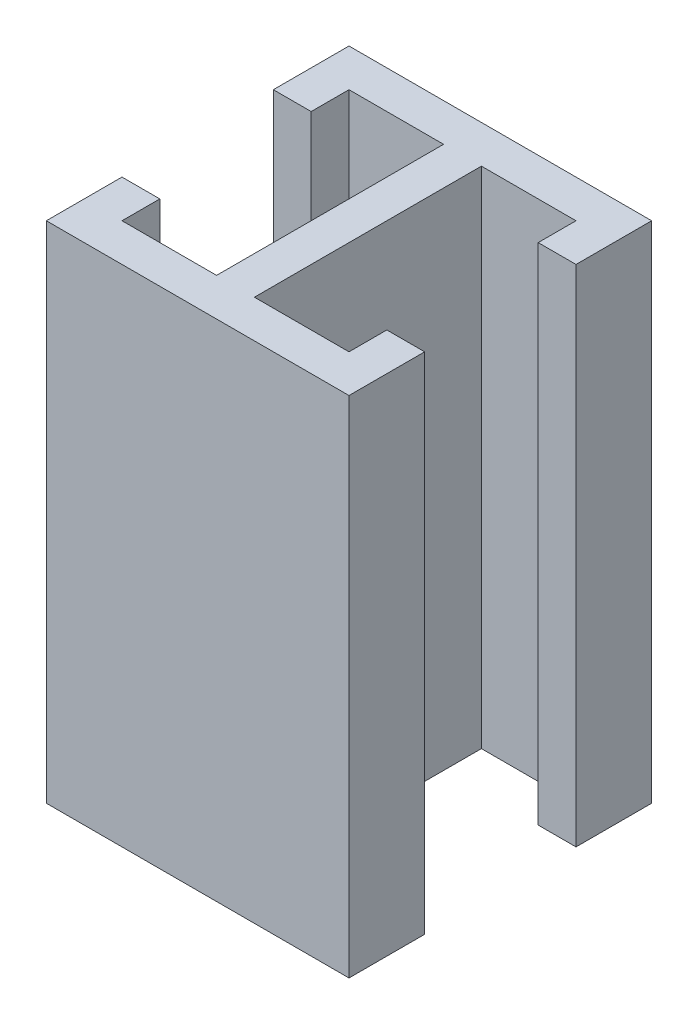
ISO-10303-21;
HEADER;
FILE_DESCRIPTION(('STEP AP214'),'2;1');
FILE_NAME('part.step','',(''),(''),'','','');
FILE_SCHEMA(('AUTOMOTIVE_DESIGN { 1 0 10303 214 1 1 1 1 }'));
ENDSEC;
DATA;
#1=APPLICATION_CONTEXT('core data for automotive mechanical design processes');
#2=APPLICATION_PROTOCOL_DEFINITION('international standard','automotive_design',2000,#1);
#3=PRODUCT_CONTEXT('',#1,'mechanical');
#4=PRODUCT('Part','Part','',(#3));
#5=PRODUCT_RELATED_PRODUCT_CATEGORY('part','',(#4));
#6=PRODUCT_DEFINITION_FORMATION('','',#4);
#7=PRODUCT_DEFINITION_CONTEXT('part definition',#1,'design');
#8=PRODUCT_DEFINITION('design','',#6,#7);
#9=PRODUCT_DEFINITION_SHAPE('','',#8);
#10=(LENGTH_UNIT() NAMED_UNIT(*) SI_UNIT(.MILLI.,.METRE.));
#11=(NAMED_UNIT(*) PLANE_ANGLE_UNIT() SI_UNIT($,.RADIAN.));
#12=(NAMED_UNIT(*) SI_UNIT($,.STERADIAN.) SOLID_ANGLE_UNIT());
#13=UNCERTAINTY_MEASURE_WITH_UNIT(LENGTH_MEASURE(1.E-05),#10,'distance_accuracy_value','');
#14=(GEOMETRIC_REPRESENTATION_CONTEXT(3) GLOBAL_UNCERTAINTY_ASSIGNED_CONTEXT((#13)) GLOBAL_UNIT_ASSIGNED_CONTEXT((#10,
#11,#12)) REPRESENTATION_CONTEXT('',''));
#15=CARTESIAN_POINT('',(0.,0.,0.));
#16=DIRECTION('',(0.,0.,1.));
#17=DIRECTION('',(1.,0.,0.));
#18=AXIS2_PLACEMENT_3D('',#15,#16,#17);
#19=CARTESIAN_POINT('',(0.,200.,0.));
#20=DIRECTION('',(1.,0.,0.));
#21=DIRECTION('',(0.,0.,-1.));
#22=AXIS2_PLACEMENT_3D('',#19,#20,#21);
#23=PLANE('',#22);
#24=DIRECTION('',(0.,0.,1.));
#25=VECTOR('',#24,1.);
#26=CARTESIAN_POINT('',(0.,0.,0.));
#27=LINE('',#26,#25);
#28=CARTESIAN_POINT('',(0.,0.,-30.));
#29=VERTEX_POINT('',#28);
#30=CARTESIAN_POINT('',(0.,0.,0.));
#31=VERTEX_POINT('',#30);
#32=EDGE_CURVE('E216',#29,#31,#27,.T.);
#33=ORIENTED_EDGE('',*,*,#32,.T.);
#34=DIRECTION('',(0.,-1.,0.));
#35=VECTOR('',#34,1.);
#36=CARTESIAN_POINT('',(0.,200.,0.));
#37=LINE('',#36,#35);
#38=CARTESIAN_POINT('',(0.,200.,0.));
#39=VERTEX_POINT('',#38);
#40=EDGE_CURVE('E11',#39,#31,#37,.T.);
#41=ORIENTED_EDGE('',*,*,#40,.F.);
#42=DIRECTION('',(0.,0.,1.));
#43=VECTOR('',#42,1.);
#44=CARTESIAN_POINT('',(0.,200.,0.));
#45=LINE('',#44,#43);
#46=CARTESIAN_POINT('',(0.,200.,-30.));
#47=VERTEX_POINT('',#46);
#48=EDGE_CURVE('E274',#47,#39,#45,.T.);
#49=ORIENTED_EDGE('',*,*,#48,.F.);
#50=DIRECTION('',(0.,-1.,0.));
#51=VECTOR('',#50,1.);
#52=CARTESIAN_POINT('',(0.,200.,-30.));
#53=LINE('',#52,#51);
#54=EDGE_CURVE('E212',#47,#29,#53,.T.);
#55=ORIENTED_EDGE('',*,*,#54,.T.);
#56=EDGE_LOOP('',(#33,#41,#49,#55));
#57=FACE_BOUND('',#56,.T.);
#58=ADVANCED_FACE('F43',(#57),#23,.F.);
#59=CARTESIAN_POINT('',(0.,200.,0.));
#60=DIRECTION('',(0.,0.,-1.));
#61=DIRECTION('',(-1.,0.,0.));
#62=AXIS2_PLACEMENT_3D('',#59,#60,#61);
#63=PLANE('',#62);
#64=DIRECTION('',(1.,0.,0.));
#65=VECTOR('',#64,1.);
#66=CARTESIAN_POINT('',(0.,0.,0.));
#67=LINE('',#66,#65);
#68=CARTESIAN_POINT('',(120.,0.,0.));
#69=VERTEX_POINT('',#68);
#70=EDGE_CURVE('E220',#31,#69,#67,.T.);
#71=ORIENTED_EDGE('',*,*,#70,.T.);
#72=DIRECTION('',(0.,-1.,0.));
#73=VECTOR('',#72,1.);
#74=CARTESIAN_POINT('',(120.,200.,0.));
#75=LINE('',#74,#73);
#76=CARTESIAN_POINT('',(120.,200.,0.));
#77=VERTEX_POINT('',#76);
#78=EDGE_CURVE('E52',#77,#69,#75,.T.);
#79=ORIENTED_EDGE('',*,*,#78,.F.);
#80=DIRECTION('',(1.,0.,0.));
#81=VECTOR('',#80,1.);
#82=CARTESIAN_POINT('',(0.,200.,0.));
#83=LINE('',#82,#81);
#84=EDGE_CURVE('E139',#39,#77,#83,.T.);
#85=ORIENTED_EDGE('',*,*,#84,.F.);
#86=ORIENTED_EDGE('',*,*,#40,.T.);
#87=EDGE_LOOP('',(#71,#79,#85,#86));
#88=FACE_BOUND('',#87,.T.);
#89=ADVANCED_FACE('F424',(#88),#63,.F.);
#90=CARTESIAN_POINT('',(120.,200.,0.));
#91=DIRECTION('',(-1.,0.,0.));
#92=DIRECTION('',(0.,0.,1.));
#93=AXIS2_PLACEMENT_3D('',#90,#91,#92);
#94=PLANE('',#93);
#95=DIRECTION('',(0.,0.,-1.));
#96=VECTOR('',#95,1.);
#97=CARTESIAN_POINT('',(120.,0.,0.));
#98=LINE('',#97,#96);
#99=CARTESIAN_POINT('',(120.,0.,-30.));
#100=VERTEX_POINT('',#99);
#101=EDGE_CURVE('E223',#69,#100,#98,.T.);
#102=ORIENTED_EDGE('',*,*,#101,.T.);
#103=DIRECTION('',(0.,-1.,0.));
#104=VECTOR('',#103,1.);
#105=CARTESIAN_POINT('',(120.,200.,-30.));
#106=LINE('',#105,#104);
#107=CARTESIAN_POINT('',(120.,200.,-30.));
#108=VERTEX_POINT('',#107);
#109=EDGE_CURVE('E333',#108,#100,#106,.T.);
#110=ORIENTED_EDGE('',*,*,#109,.F.);
#111=DIRECTION('',(0.,0.,-1.));
#112=VECTOR('',#111,1.);
#113=CARTESIAN_POINT('',(120.,200.,0.));
#114=LINE('',#113,#112);
#115=EDGE_CURVE('E343',#77,#108,#114,.T.);
#116=ORIENTED_EDGE('',*,*,#115,.F.);
#117=ORIENTED_EDGE('',*,*,#78,.T.);
#118=EDGE_LOOP('',(#102,#110,#116,#117));
#119=FACE_BOUND('',#118,.T.);
#120=ADVANCED_FACE('F341',(#119),#94,.F.);
#121=CARTESIAN_POINT('',(105.,200.,-30.));
#122=DIRECTION('',(0.,0.,1.));
#123=DIRECTION('',(1.,0.,0.));
#124=AXIS2_PLACEMENT_3D('',#121,#122,#123);
#125=PLANE('',#124);
#126=DIRECTION('',(-1.,0.,0.));
#127=VECTOR('',#126,1.);
#128=CARTESIAN_POINT('',(105.,0.,-30.));
#129=LINE('',#128,#127);
#130=CARTESIAN_POINT('',(105.,0.,-30.));
#131=VERTEX_POINT('',#130);
#132=EDGE_CURVE('E226',#100,#131,#129,.T.);
#133=ORIENTED_EDGE('',*,*,#132,.T.);
#134=DIRECTION('',(0.,-1.,0.));
#135=VECTOR('',#134,1.);
#136=CARTESIAN_POINT('',(105.,200.,-30.));
#137=LINE('',#136,#135);
#138=CARTESIAN_POINT('',(105.,200.,-30.));
#139=VERTEX_POINT('',#138);
#140=EDGE_CURVE('E329',#139,#131,#137,.T.);
#141=ORIENTED_EDGE('',*,*,#140,.F.);
#142=DIRECTION('',(-1.,0.,0.));
#143=VECTOR('',#142,1.);
#144=CARTESIAN_POINT('',(105.,200.,-30.));
#145=LINE('',#144,#143);
#146=EDGE_CURVE('E362',#108,#139,#145,.T.);
#147=ORIENTED_EDGE('',*,*,#146,.F.);
#148=ORIENTED_EDGE('',*,*,#109,.T.);
#149=EDGE_LOOP('',(#133,#141,#147,#148));
#150=FACE_BOUND('',#149,.T.);
#151=ADVANCED_FACE('F352',(#150),#125,.F.);
#152=CARTESIAN_POINT('',(105.,200.,-30.));
#153=DIRECTION('',(1.,0.,0.));
#154=DIRECTION('',(0.,0.,-1.));
#155=AXIS2_PLACEMENT_3D('',#152,#153,#154);
#156=PLANE('',#155);
#157=DIRECTION('',(0.,0.,1.));
#158=VECTOR('',#157,1.);
#159=CARTESIAN_POINT('',(105.,0.,-30.));
#160=LINE('',#159,#158);
#161=CARTESIAN_POINT('',(105.,0.,-15.));
#162=VERTEX_POINT('',#161);
#163=EDGE_CURVE('E229',#131,#162,#160,.T.);
#164=ORIENTED_EDGE('',*,*,#163,.T.);
#165=DIRECTION('',(0.,-1.,0.));
#166=VECTOR('',#165,1.);
#167=CARTESIAN_POINT('',(105.,200.,-15.));
#168=LINE('',#167,#166);
#169=CARTESIAN_POINT('',(105.,200.,-15.));
#170=VERTEX_POINT('',#169);
#171=EDGE_CURVE('E325',#170,#162,#168,.T.);
#172=ORIENTED_EDGE('',*,*,#171,.F.);
#173=DIRECTION('',(0.,0.,1.));
#174=VECTOR('',#173,1.);
#175=CARTESIAN_POINT('',(105.,200.,-30.));
#176=LINE('',#175,#174);
#177=EDGE_CURVE('E358',#139,#170,#176,.T.);
#178=ORIENTED_EDGE('',*,*,#177,.F.);
#179=ORIENTED_EDGE('',*,*,#140,.T.);
#180=EDGE_LOOP('',(#164,#172,#178,#179));
#181=FACE_BOUND('',#180,.T.);
#182=ADVANCED_FACE('F356',(#181),#156,.F.);
#183=CARTESIAN_POINT('',(67.5,200.,-15.));
#184=DIRECTION('',(0.,0.,1.));
#185=DIRECTION('',(1.,0.,0.));
#186=AXIS2_PLACEMENT_3D('',#183,#184,#185);
#187=PLANE('',#186);
#188=DIRECTION('',(-1.,0.,0.));
#189=VECTOR('',#188,1.);
#190=CARTESIAN_POINT('',(67.5,0.,-15.));
#191=LINE('',#190,#189);
#192=CARTESIAN_POINT('',(67.5,0.,-15.));
#193=VERTEX_POINT('',#192);
#194=EDGE_CURVE('E232',#162,#193,#191,.T.);
#195=ORIENTED_EDGE('',*,*,#194,.T.);
#196=DIRECTION('',(0.,-1.,0.));
#197=VECTOR('',#196,1.);
#198=CARTESIAN_POINT('',(67.5,200.,-15.));
#199=LINE('',#198,#197);
#200=CARTESIAN_POINT('',(67.5,200.,-15.));
#201=VERTEX_POINT('',#200);
#202=EDGE_CURVE('E321',#201,#193,#199,.T.);
#203=ORIENTED_EDGE('',*,*,#202,.F.);
#204=DIRECTION('',(-1.,0.,0.));
#205=VECTOR('',#204,1.);
#206=CARTESIAN_POINT('',(67.5,200.,-15.));
#207=LINE('',#206,#205);
#208=EDGE_CURVE('E361',#170,#201,#207,.T.);
#209=ORIENTED_EDGE('',*,*,#208,.F.);
#210=ORIENTED_EDGE('',*,*,#171,.T.);
#211=EDGE_LOOP('',(#195,#203,#209,#210));
#212=FACE_BOUND('',#211,.T.);
#213=ADVANCED_FACE('F437',(#212),#187,.F.);
#214=CARTESIAN_POINT('',(67.5,200.,-105.));
#215=DIRECTION('',(-1.,0.,0.));
#216=DIRECTION('',(0.,0.,1.));
#217=AXIS2_PLACEMENT_3D('',#214,#215,#216);
#218=PLANE('',#217);
#219=DIRECTION('',(0.,0.,-1.));
#220=VECTOR('',#219,1.);
#221=CARTESIAN_POINT('',(67.5,0.,-105.));
#222=LINE('',#221,#220);
#223=CARTESIAN_POINT('',(67.5,0.,-105.));
#224=VERTEX_POINT('',#223);
#225=EDGE_CURVE('E235',#193,#224,#222,.T.);
#226=ORIENTED_EDGE('',*,*,#225,.T.);
#227=DIRECTION('',(0.,-1.,0.));
#228=VECTOR('',#227,1.);
#229=CARTESIAN_POINT('',(67.5,200.,-105.));
#230=LINE('',#229,#228);
#231=CARTESIAN_POINT('',(67.5,200.,-105.));
#232=VERTEX_POINT('',#231);
#233=EDGE_CURVE('E317',#232,#224,#230,.T.);
#234=ORIENTED_EDGE('',*,*,#233,.F.);
#235=DIRECTION('',(0.,0.,-1.));
#236=VECTOR('',#235,1.);
#237=CARTESIAN_POINT('',(67.5,200.,-105.));
#238=LINE('',#237,#236);
#239=EDGE_CURVE('E366',#201,#232,#238,.T.);
#240=ORIENTED_EDGE('',*,*,#239,.F.);
#241=ORIENTED_EDGE('',*,*,#202,.T.);
#242=EDGE_LOOP('',(#226,#234,#240,#241));
#243=FACE_BOUND('',#242,.T.);
#244=ADVANCED_FACE('F440',(#243),#218,.F.);
#245=CARTESIAN_POINT('',(67.5,200.,-105.));
#246=DIRECTION('',(0.,0.,-1.));
#247=DIRECTION('',(-1.,0.,0.));
#248=AXIS2_PLACEMENT_3D('',#245,#246,#247);
#249=PLANE('',#248);
#250=DIRECTION('',(1.,0.,0.));
#251=VECTOR('',#250,1.);
#252=CARTESIAN_POINT('',(67.5,0.,-105.));
#253=LINE('',#252,#251);
#254=CARTESIAN_POINT('',(105.,0.,-105.));
#255=VERTEX_POINT('',#254);
#256=EDGE_CURVE('E238',#224,#255,#253,.T.);
#257=ORIENTED_EDGE('',*,*,#256,.T.);
#258=DIRECTION('',(0.,-1.,0.));
#259=VECTOR('',#258,1.);
#260=CARTESIAN_POINT('',(105.,200.,-105.));
#261=LINE('',#260,#259);
#262=CARTESIAN_POINT('',(105.,200.,-105.));
#263=VERTEX_POINT('',#262);
#264=EDGE_CURVE('E313',#263,#255,#261,.T.);
#265=ORIENTED_EDGE('',*,*,#264,.F.);
#266=DIRECTION('',(1.,0.,0.));
#267=VECTOR('',#266,1.);
#268=CARTESIAN_POINT('',(67.5,200.,-105.));
#269=LINE('',#268,#267);
#270=EDGE_CURVE('E373',#232,#263,#269,.T.);
#271=ORIENTED_EDGE('',*,*,#270,.F.);
#272=ORIENTED_EDGE('',*,*,#233,.T.);
#273=EDGE_LOOP('',(#257,#265,#271,#272));
#274=FACE_BOUND('',#273,.T.);
#275=ADVANCED_FACE('F444',(#274),#249,.F.);
#276=CARTESIAN_POINT('',(105.,200.,-105.));
#277=DIRECTION('',(1.,0.,0.));
#278=DIRECTION('',(0.,0.,-1.));
#279=AXIS2_PLACEMENT_3D('',#276,#277,#278);
#280=PLANE('',#279);
#281=DIRECTION('',(0.,0.,1.));
#282=VECTOR('',#281,1.);
#283=CARTESIAN_POINT('',(105.,0.,-105.));
#284=LINE('',#283,#282);
#285=CARTESIAN_POINT('',(105.,0.,-90.));
#286=VERTEX_POINT('',#285);
#287=EDGE_CURVE('E241',#255,#286,#284,.T.);
#288=ORIENTED_EDGE('',*,*,#287,.T.);
#289=DIRECTION('',(0.,-1.,0.));
#290=VECTOR('',#289,1.);
#291=CARTESIAN_POINT('',(105.,200.,-90.));
#292=LINE('',#291,#290);
#293=CARTESIAN_POINT('',(105.,200.,-90.));
#294=VERTEX_POINT('',#293);
#295=EDGE_CURVE('E309',#294,#286,#292,.T.);
#296=ORIENTED_EDGE('',*,*,#295,.F.);
#297=DIRECTION('',(0.,0.,1.));
#298=VECTOR('',#297,1.);
#299=CARTESIAN_POINT('',(105.,200.,-105.));
#300=LINE('',#299,#298);
#301=EDGE_CURVE('E376',#263,#294,#300,.T.);
#302=ORIENTED_EDGE('',*,*,#301,.F.);
#303=ORIENTED_EDGE('',*,*,#264,.T.);
#304=EDGE_LOOP('',(#288,#296,#302,#303));
#305=FACE_BOUND('',#304,.T.);
#306=ADVANCED_FACE('F448',(#305),#280,.F.);
#307=CARTESIAN_POINT('',(105.,200.,-90.));
#308=DIRECTION('',(0.,0.,-1.));
#309=DIRECTION('',(-1.,0.,0.));
#310=AXIS2_PLACEMENT_3D('',#307,#308,#309);
#311=PLANE('',#310);
#312=DIRECTION('',(1.,0.,0.));
#313=VECTOR('',#312,1.);
#314=CARTESIAN_POINT('',(105.,0.,-90.));
#315=LINE('',#314,#313);
#316=CARTESIAN_POINT('',(120.,0.,-90.));
#317=VERTEX_POINT('',#316);
#318=EDGE_CURVE('E244',#286,#317,#315,.T.);
#319=ORIENTED_EDGE('',*,*,#318,.T.);
#320=DIRECTION('',(0.,-1.,0.));
#321=VECTOR('',#320,1.);
#322=CARTESIAN_POINT('',(120.,200.,-90.));
#323=LINE('',#322,#321);
#324=CARTESIAN_POINT('',(120.,200.,-90.));
#325=VERTEX_POINT('',#324);
#326=EDGE_CURVE('E305',#325,#317,#323,.T.);
#327=ORIENTED_EDGE('',*,*,#326,.F.);
#328=DIRECTION('',(1.,0.,0.));
#329=VECTOR('',#328,1.);
#330=CARTESIAN_POINT('',(105.,200.,-90.));
#331=LINE('',#330,#329);
#332=EDGE_CURVE('E379',#294,#325,#331,.T.);
#333=ORIENTED_EDGE('',*,*,#332,.F.);
#334=ORIENTED_EDGE('',*,*,#295,.T.);
#335=EDGE_LOOP('',(#319,#327,#333,#334));
#336=FACE_BOUND('',#335,.T.);
#337=ADVANCED_FACE('F452',(#336),#311,.F.);
#338=CARTESIAN_POINT('',(120.,200.,-90.));
#339=DIRECTION('',(-1.,0.,0.));
#340=DIRECTION('',(0.,0.,1.));
#341=AXIS2_PLACEMENT_3D('',#338,#339,#340);
#342=PLANE('',#341);
#343=DIRECTION('',(0.,0.,-1.));
#344=VECTOR('',#343,1.);
#345=CARTESIAN_POINT('',(120.,0.,-90.));
#346=LINE('',#345,#344);
#347=CARTESIAN_POINT('',(120.,0.,-120.));
#348=VERTEX_POINT('',#347);
#349=EDGE_CURVE('E247',#317,#348,#346,.T.);
#350=ORIENTED_EDGE('',*,*,#349,.T.);
#351=DIRECTION('',(0.,-1.,0.));
#352=VECTOR('',#351,1.);
#353=CARTESIAN_POINT('',(120.,200.,-120.));
#354=LINE('',#353,#352);
#355=CARTESIAN_POINT('',(120.,200.,-120.));
#356=VERTEX_POINT('',#355);
#357=EDGE_CURVE('E301',#356,#348,#354,.T.);
#358=ORIENTED_EDGE('',*,*,#357,.F.);
#359=DIRECTION('',(0.,0.,-1.));
#360=VECTOR('',#359,1.);
#361=CARTESIAN_POINT('',(120.,200.,-90.));
#362=LINE('',#361,#360);
#363=EDGE_CURVE('E382',#325,#356,#362,.T.);
#364=ORIENTED_EDGE('',*,*,#363,.F.);
#365=ORIENTED_EDGE('',*,*,#326,.T.);
#366=EDGE_LOOP('',(#350,#358,#364,#365));
#367=FACE_BOUND('',#366,.T.);
#368=ADVANCED_FACE('F456',(#367),#342,.F.);
#369=CARTESIAN_POINT('',(0.,200.,-120.));
#370=DIRECTION('',(0.,0.,1.));
#371=DIRECTION('',(1.,0.,0.));
#372=AXIS2_PLACEMENT_3D('',#369,#370,#371);
#373=PLANE('',#372);
#374=DIRECTION('',(-1.,0.,0.));
#375=VECTOR('',#374,1.);
#376=CARTESIAN_POINT('',(0.,0.,-120.));
#377=LINE('',#376,#375);
#378=CARTESIAN_POINT('',(0.,0.,-120.));
#379=VERTEX_POINT('',#378);
#380=EDGE_CURVE('E250',#348,#379,#377,.T.);
#381=ORIENTED_EDGE('',*,*,#380,.T.);
#382=DIRECTION('',(0.,-1.,0.));
#383=VECTOR('',#382,1.);
#384=CARTESIAN_POINT('',(0.,200.,-120.));
#385=LINE('',#384,#383);
#386=CARTESIAN_POINT('',(0.,200.,-120.));
#387=VERTEX_POINT('',#386);
#388=EDGE_CURVE('E297',#387,#379,#385,.T.);
#389=ORIENTED_EDGE('',*,*,#388,.F.);
#390=DIRECTION('',(-1.,0.,0.));
#391=VECTOR('',#390,1.);
#392=CARTESIAN_POINT('',(0.,200.,-120.));
#393=LINE('',#392,#391);
#394=EDGE_CURVE('E385',#356,#387,#393,.T.);
#395=ORIENTED_EDGE('',*,*,#394,.F.);
#396=ORIENTED_EDGE('',*,*,#357,.T.);
#397=EDGE_LOOP('',(#381,#389,#395,#396));
#398=FACE_BOUND('',#397,.T.);
#399=ADVANCED_FACE('F460',(#398),#373,.F.);
#400=CARTESIAN_POINT('',(0.,200.,-90.));
#401=DIRECTION('',(1.,0.,0.));
#402=DIRECTION('',(0.,0.,-1.));
#403=AXIS2_PLACEMENT_3D('',#400,#401,#402);
#404=PLANE('',#403);
#405=DIRECTION('',(0.,0.,1.));
#406=VECTOR('',#405,1.);
#407=CARTESIAN_POINT('',(0.,0.,-90.));
#408=LINE('',#407,#406);
#409=CARTESIAN_POINT('',(0.,0.,-90.));
#410=VERTEX_POINT('',#409);
#411=EDGE_CURVE('E253',#379,#410,#408,.T.);
#412=ORIENTED_EDGE('',*,*,#411,.T.);
#413=DIRECTION('',(0.,-1.,0.));
#414=VECTOR('',#413,1.);
#415=CARTESIAN_POINT('',(0.,200.,-90.));
#416=LINE('',#415,#414);
#417=CARTESIAN_POINT('',(0.,200.,-90.));
#418=VERTEX_POINT('',#417);
#419=EDGE_CURVE('E293',#418,#410,#416,.T.);
#420=ORIENTED_EDGE('',*,*,#419,.F.);
#421=DIRECTION('',(0.,0.,1.));
#422=VECTOR('',#421,1.);
#423=CARTESIAN_POINT('',(0.,200.,-90.));
#424=LINE('',#423,#422);
#425=EDGE_CURVE('E388',#387,#418,#424,.T.);
#426=ORIENTED_EDGE('',*,*,#425,.F.);
#427=ORIENTED_EDGE('',*,*,#388,.T.);
#428=EDGE_LOOP('',(#412,#420,#426,#427));
#429=FACE_BOUND('',#428,.T.);
#430=ADVANCED_FACE('F464',(#429),#404,.F.);
#431=CARTESIAN_POINT('',(15.,200.,-90.));
#432=DIRECTION('',(0.,0.,-1.));
#433=DIRECTION('',(-1.,0.,0.));
#434=AXIS2_PLACEMENT_3D('',#431,#432,#433);
#435=PLANE('',#434);
#436=DIRECTION('',(1.,0.,0.));
#437=VECTOR('',#436,1.);
#438=CARTESIAN_POINT('',(15.,0.,-90.));
#439=LINE('',#438,#437);
#440=CARTESIAN_POINT('',(15.,0.,-90.));
#441=VERTEX_POINT('',#440);
#442=EDGE_CURVE('E256',#410,#441,#439,.T.);
#443=ORIENTED_EDGE('',*,*,#442,.T.);
#444=DIRECTION('',(0.,-1.,0.));
#445=VECTOR('',#444,1.);
#446=CARTESIAN_POINT('',(15.,200.,-90.));
#447=LINE('',#446,#445);
#448=CARTESIAN_POINT('',(15.,200.,-90.));
#449=VERTEX_POINT('',#448);
#450=EDGE_CURVE('E289',#449,#441,#447,.T.);
#451=ORIENTED_EDGE('',*,*,#450,.F.);
#452=DIRECTION('',(1.,0.,0.));
#453=VECTOR('',#452,1.);
#454=CARTESIAN_POINT('',(15.,200.,-90.));
#455=LINE('',#454,#453);
#456=EDGE_CURVE('E391',#418,#449,#455,.T.);
#457=ORIENTED_EDGE('',*,*,#456,.F.);
#458=ORIENTED_EDGE('',*,*,#419,.T.);
#459=EDGE_LOOP('',(#443,#451,#457,#458));
#460=FACE_BOUND('',#459,.T.);
#461=ADVANCED_FACE('F468',(#460),#435,.F.);
#462=CARTESIAN_POINT('',(15.,200.,-105.));
#463=DIRECTION('',(-1.,0.,0.));
#464=DIRECTION('',(0.,0.,1.));
#465=AXIS2_PLACEMENT_3D('',#462,#463,#464);
#466=PLANE('',#465);
#467=DIRECTION('',(0.,0.,-1.));
#468=VECTOR('',#467,1.);
#469=CARTESIAN_POINT('',(15.,0.,-105.));
#470=LINE('',#469,#468);
#471=CARTESIAN_POINT('',(15.,0.,-105.));
#472=VERTEX_POINT('',#471);
#473=EDGE_CURVE('E259',#441,#472,#470,.T.);
#474=ORIENTED_EDGE('',*,*,#473,.T.);
#475=DIRECTION('',(0.,-1.,0.));
#476=VECTOR('',#475,1.);
#477=CARTESIAN_POINT('',(15.,200.,-105.));
#478=LINE('',#477,#476);
#479=CARTESIAN_POINT('',(15.,200.,-105.));
#480=VERTEX_POINT('',#479);
#481=EDGE_CURVE('E285',#480,#472,#478,.T.);
#482=ORIENTED_EDGE('',*,*,#481,.F.);
#483=DIRECTION('',(0.,0.,-1.));
#484=VECTOR('',#483,1.);
#485=CARTESIAN_POINT('',(15.,200.,-105.));
#486=LINE('',#485,#484);
#487=EDGE_CURVE('E394',#449,#480,#486,.T.);
#488=ORIENTED_EDGE('',*,*,#487,.F.);
#489=ORIENTED_EDGE('',*,*,#450,.T.);
#490=EDGE_LOOP('',(#474,#482,#488,#489));
#491=FACE_BOUND('',#490,.T.);
#492=ADVANCED_FACE('F472',(#491),#466,.F.);
#493=CARTESIAN_POINT('',(52.5,200.,-105.));
#494=DIRECTION('',(0.,0.,-1.));
#495=DIRECTION('',(-1.,0.,0.));
#496=AXIS2_PLACEMENT_3D('',#493,#494,#495);
#497=PLANE('',#496);
#498=DIRECTION('',(1.,0.,0.));
#499=VECTOR('',#498,1.);
#500=CARTESIAN_POINT('',(52.5,0.,-105.));
#501=LINE('',#500,#499);
#502=CARTESIAN_POINT('',(52.5,0.,-105.));
#503=VERTEX_POINT('',#502);
#504=EDGE_CURVE('E262',#472,#503,#501,.T.);
#505=ORIENTED_EDGE('',*,*,#504,.T.);
#506=DIRECTION('',(0.,-1.,0.));
#507=VECTOR('',#506,1.);
#508=CARTESIAN_POINT('',(52.5,200.,-105.));
#509=LINE('',#508,#507);
#510=CARTESIAN_POINT('',(52.5,200.,-105.));
#511=VERTEX_POINT('',#510);
#512=EDGE_CURVE('E281',#511,#503,#509,.T.);
#513=ORIENTED_EDGE('',*,*,#512,.F.);
#514=DIRECTION('',(1.,0.,0.));
#515=VECTOR('',#514,1.);
#516=CARTESIAN_POINT('',(52.5,200.,-105.));
#517=LINE('',#516,#515);
#518=EDGE_CURVE('E397',#480,#511,#517,.T.);
#519=ORIENTED_EDGE('',*,*,#518,.F.);
#520=ORIENTED_EDGE('',*,*,#481,.T.);
#521=EDGE_LOOP('',(#505,#513,#519,#520));
#522=FACE_BOUND('',#521,.T.);
#523=ADVANCED_FACE('F405',(#522),#497,.F.);
#524=CARTESIAN_POINT('',(52.5,200.,-105.));
#525=DIRECTION('',(1.,0.,0.));
#526=DIRECTION('',(0.,0.,-1.));
#527=AXIS2_PLACEMENT_3D('',#524,#525,#526);
#528=PLANE('',#527);
#529=DIRECTION('',(0.,0.,1.));
#530=VECTOR('',#529,1.);
#531=CARTESIAN_POINT('',(52.5,0.,-105.));
#532=LINE('',#531,#530);
#533=CARTESIAN_POINT('',(52.5,0.,-15.));
#534=VERTEX_POINT('',#533);
#535=EDGE_CURVE('E265',#503,#534,#532,.T.);
#536=ORIENTED_EDGE('',*,*,#535,.T.);
#537=DIRECTION('',(0.,-1.,0.));
#538=VECTOR('',#537,1.);
#539=CARTESIAN_POINT('',(52.5,200.,-15.));
#540=LINE('',#539,#538);
#541=CARTESIAN_POINT('',(52.5,200.,-15.));
#542=VERTEX_POINT('',#541);
#543=EDGE_CURVE('E205',#542,#534,#540,.T.);
#544=ORIENTED_EDGE('',*,*,#543,.F.);
#545=DIRECTION('',(0.,0.,1.));
#546=VECTOR('',#545,1.);
#547=CARTESIAN_POINT('',(52.5,200.,-105.));
#548=LINE('',#547,#546);
#549=EDGE_CURVE('E194',#511,#542,#548,.T.);
#550=ORIENTED_EDGE('',*,*,#549,.F.);
#551=ORIENTED_EDGE('',*,*,#512,.T.);
#552=EDGE_LOOP('',(#536,#544,#550,#551));
#553=FACE_BOUND('',#552,.T.);
#554=ADVANCED_FACE('F409',(#553),#528,.F.);
#555=CARTESIAN_POINT('',(52.5,200.,-15.));
#556=DIRECTION('',(0.,0.,1.));
#557=DIRECTION('',(1.,0.,0.));
#558=AXIS2_PLACEMENT_3D('',#555,#556,#557);
#559=PLANE('',#558);
#560=DIRECTION('',(-1.,0.,0.));
#561=VECTOR('',#560,1.);
#562=CARTESIAN_POINT('',(52.5,0.,-15.));
#563=LINE('',#562,#561);
#564=CARTESIAN_POINT('',(15.,0.,-15.));
#565=VERTEX_POINT('',#564);
#566=EDGE_CURVE('E203',#534,#565,#563,.T.);
#567=ORIENTED_EDGE('',*,*,#566,.T.);
#568=DIRECTION('',(0.,-1.,0.));
#569=VECTOR('',#568,1.);
#570=CARTESIAN_POINT('',(15.,200.,-15.));
#571=LINE('',#570,#569);
#572=CARTESIAN_POINT('',(15.,200.,-15.));
#573=VERTEX_POINT('',#572);
#574=EDGE_CURVE('E200',#573,#565,#571,.T.);
#575=ORIENTED_EDGE('',*,*,#574,.F.);
#576=DIRECTION('',(-1.,0.,0.));
#577=VECTOR('',#576,1.);
#578=CARTESIAN_POINT('',(52.5,200.,-15.));
#579=LINE('',#578,#577);
#580=EDGE_CURVE('E188',#542,#573,#579,.T.);
#581=ORIENTED_EDGE('',*,*,#580,.F.);
#582=ORIENTED_EDGE('',*,*,#543,.T.);
#583=EDGE_LOOP('',(#567,#575,#581,#582));
#584=FACE_BOUND('',#583,.T.);
#585=ADVANCED_FACE('F201',(#584),#559,.F.);
#586=CARTESIAN_POINT('',(15.,200.,-30.));
#587=DIRECTION('',(-1.,0.,0.));
#588=DIRECTION('',(0.,0.,1.));
#589=AXIS2_PLACEMENT_3D('',#586,#587,#588);
#590=PLANE('',#589);
#591=DIRECTION('',(0.,0.,-1.));
#592=VECTOR('',#591,1.);
#593=CARTESIAN_POINT('',(15.,0.,-30.));
#594=LINE('',#593,#592);
#595=CARTESIAN_POINT('',(15.,0.,-30.));
#596=VERTEX_POINT('',#595);
#597=EDGE_CURVE('E125',#565,#596,#594,.T.);
#598=ORIENTED_EDGE('',*,*,#597,.T.);
#599=DIRECTION('',(0.,-1.,0.));
#600=VECTOR('',#599,1.);
#601=CARTESIAN_POINT('',(15.,200.,-30.));
#602=LINE('',#601,#600);
#603=CARTESIAN_POINT('',(15.,200.,-30.));
#604=VERTEX_POINT('',#603);
#605=EDGE_CURVE('E206',#604,#596,#602,.T.);
#606=ORIENTED_EDGE('',*,*,#605,.F.);
#607=DIRECTION('',(0.,0.,-1.));
#608=VECTOR('',#607,1.);
#609=CARTESIAN_POINT('',(15.,200.,-30.));
#610=LINE('',#609,#608);
#611=EDGE_CURVE('E192',#573,#604,#610,.T.);
#612=ORIENTED_EDGE('',*,*,#611,.F.);
#613=ORIENTED_EDGE('',*,*,#574,.T.);
#614=EDGE_LOOP('',(#598,#606,#612,#613));
#615=FACE_BOUND('',#614,.T.);
#616=ADVANCED_FACE('F208',(#615),#590,.F.);
#617=CARTESIAN_POINT('',(15.,200.,-30.));
#618=DIRECTION('',(0.,0.,1.));
#619=DIRECTION('',(1.,0.,0.));
#620=AXIS2_PLACEMENT_3D('',#617,#618,#619);
#621=PLANE('',#620);
#622=DIRECTION('',(-1.,0.,0.));
#623=VECTOR('',#622,1.);
#624=CARTESIAN_POINT('',(15.,0.,-30.));
#625=LINE('',#624,#623);
#626=EDGE_CURVE('E131',#596,#29,#625,.T.);
#627=ORIENTED_EDGE('',*,*,#626,.T.);
#628=ORIENTED_EDGE('',*,*,#54,.F.);
#629=DIRECTION('',(-1.,0.,0.));
#630=VECTOR('',#629,1.);
#631=CARTESIAN_POINT('',(15.,200.,-30.));
#632=LINE('',#631,#630);
#633=EDGE_CURVE('E60',#604,#47,#632,.T.);
#634=ORIENTED_EDGE('',*,*,#633,.F.);
#635=ORIENTED_EDGE('',*,*,#605,.T.);
#636=EDGE_LOOP('',(#627,#628,#634,#635));
#637=FACE_BOUND('',#636,.T.);
#638=ADVANCED_FACE('F413',(#637),#621,.F.);
#639=CARTESIAN_POINT('',(0.,200.,0.));
#640=DIRECTION('',(0.,1.,0.));
#641=DIRECTION('',(0.,0.,1.));
#642=AXIS2_PLACEMENT_3D('',#639,#640,#641);
#643=PLANE('',#642);
#644=ORIENTED_EDGE('',*,*,#48,.T.);
#645=ORIENTED_EDGE('',*,*,#84,.T.);
#646=ORIENTED_EDGE('',*,*,#115,.T.);
#647=ORIENTED_EDGE('',*,*,#146,.T.);
#648=ORIENTED_EDGE('',*,*,#177,.T.);
#649=ORIENTED_EDGE('',*,*,#208,.T.);
#650=ORIENTED_EDGE('',*,*,#239,.T.);
#651=ORIENTED_EDGE('',*,*,#270,.T.);
#652=ORIENTED_EDGE('',*,*,#301,.T.);
#653=ORIENTED_EDGE('',*,*,#332,.T.);
#654=ORIENTED_EDGE('',*,*,#363,.T.);
#655=ORIENTED_EDGE('',*,*,#394,.T.);
#656=ORIENTED_EDGE('',*,*,#425,.T.);
#657=ORIENTED_EDGE('',*,*,#456,.T.);
#658=ORIENTED_EDGE('',*,*,#487,.T.);
#659=ORIENTED_EDGE('',*,*,#518,.T.);
#660=ORIENTED_EDGE('',*,*,#549,.T.);
#661=ORIENTED_EDGE('',*,*,#580,.T.);
#662=ORIENTED_EDGE('',*,*,#611,.T.);
#663=ORIENTED_EDGE('',*,*,#633,.T.);
#664=EDGE_LOOP('',(#644,#645,#646,#647,#648,#649,#650,#651,#652,#653,#654,#655,#656,#657,#658,
#659,#660,#661,#662,#663));
#665=FACE_BOUND('',#664,.T.);
#666=ADVANCED_FACE('F190',(#665),#643,.T.);
#667=CARTESIAN_POINT('',(0.,0.,0.));
#668=DIRECTION('',(0.,1.,0.));
#669=DIRECTION('',(0.,0.,1.));
#670=AXIS2_PLACEMENT_3D('',#667,#668,#669);
#671=PLANE('',#670);
#672=ORIENTED_EDGE('',*,*,#32,.F.);
#673=ORIENTED_EDGE('',*,*,#626,.F.);
#674=ORIENTED_EDGE('',*,*,#597,.F.);
#675=ORIENTED_EDGE('',*,*,#566,.F.);
#676=ORIENTED_EDGE('',*,*,#535,.F.);
#677=ORIENTED_EDGE('',*,*,#504,.F.);
#678=ORIENTED_EDGE('',*,*,#473,.F.);
#679=ORIENTED_EDGE('',*,*,#442,.F.);
#680=ORIENTED_EDGE('',*,*,#411,.F.);
#681=ORIENTED_EDGE('',*,*,#380,.F.);
#682=ORIENTED_EDGE('',*,*,#349,.F.);
#683=ORIENTED_EDGE('',*,*,#318,.F.);
#684=ORIENTED_EDGE('',*,*,#287,.F.);
#685=ORIENTED_EDGE('',*,*,#256,.F.);
#686=ORIENTED_EDGE('',*,*,#225,.F.);
#687=ORIENTED_EDGE('',*,*,#194,.F.);
#688=ORIENTED_EDGE('',*,*,#163,.F.);
#689=ORIENTED_EDGE('',*,*,#132,.F.);
#690=ORIENTED_EDGE('',*,*,#101,.F.);
#691=ORIENTED_EDGE('',*,*,#70,.F.);
#692=EDGE_LOOP('',(#672,#673,#674,#675,#676,#677,#678,#679,#680,#681,#682,#683,#684,#685,#686,
#687,#688,#689,#690,#691));
#693=FACE_BOUND('',#692,.T.);
#694=ADVANCED_FACE('F347',(#693),#671,.F.);
#695=CLOSED_SHELL('',(#58,#89,#120,#151,#182,#213,#244,#275,#306,#337,#368,#399,#430,#461,#492,
#523,#554,#585,#616,#638,#666,#694));
#696=MANIFOLD_SOLID_BREP('B2',#695);
#697=ADVANCED_BREP_SHAPE_REPRESENTATION('',(#18,#696),#14);
#698=SHAPE_DEFINITION_REPRESENTATION(#9,#697);
ENDSEC;
END-ISO-10303-21;
